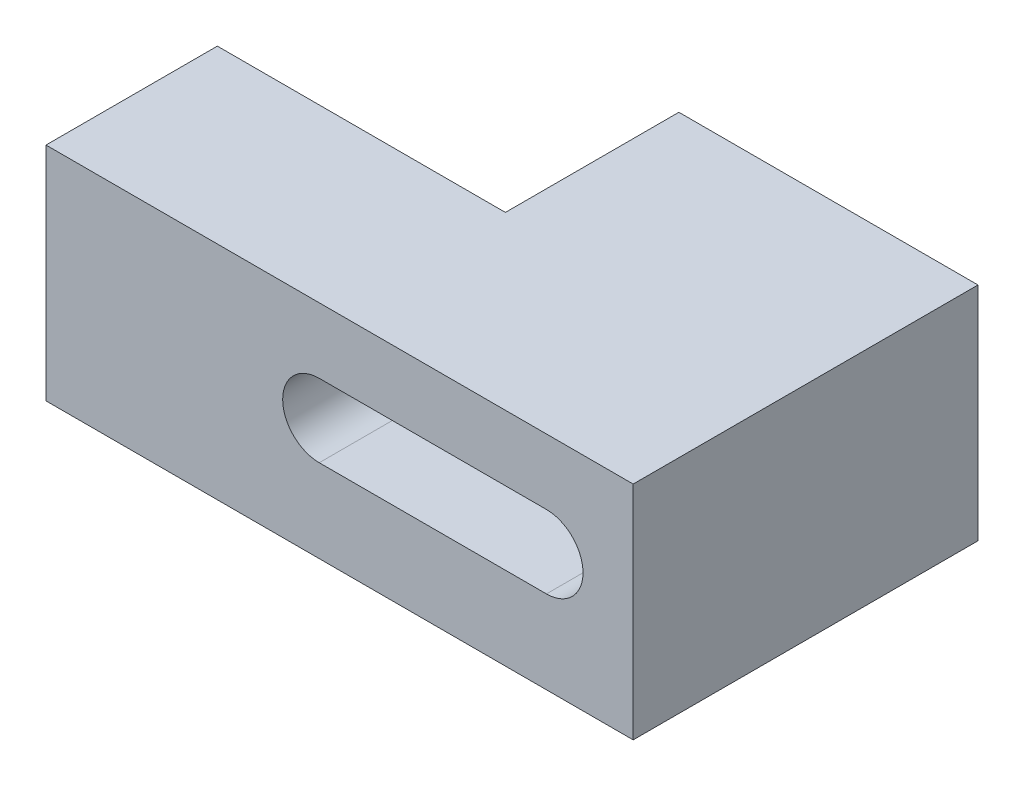
ISO-10303-21;
HEADER;
FILE_DESCRIPTION(('STEP AP214'),'2;1');
FILE_NAME('part.step','',(''),(''),'','','');
FILE_SCHEMA(('AUTOMOTIVE_DESIGN { 1 0 10303 214 1 1 1 1 }'));
ENDSEC;
DATA;
#1=APPLICATION_CONTEXT('core data for automotive mechanical design processes');
#2=APPLICATION_PROTOCOL_DEFINITION('international standard','automotive_design',2000,#1);
#3=PRODUCT_CONTEXT('',#1,'mechanical');
#4=PRODUCT('Part','Part','',(#3));
#5=PRODUCT_RELATED_PRODUCT_CATEGORY('part','',(#4));
#6=PRODUCT_DEFINITION_FORMATION('','',#4);
#7=PRODUCT_DEFINITION_CONTEXT('part definition',#1,'design');
#8=PRODUCT_DEFINITION('design','',#6,#7);
#9=PRODUCT_DEFINITION_SHAPE('','',#8);
#10=(LENGTH_UNIT() NAMED_UNIT(*) SI_UNIT(.MILLI.,.METRE.));
#11=(NAMED_UNIT(*) PLANE_ANGLE_UNIT() SI_UNIT($,.RADIAN.));
#12=(NAMED_UNIT(*) SI_UNIT($,.STERADIAN.) SOLID_ANGLE_UNIT());
#13=UNCERTAINTY_MEASURE_WITH_UNIT(LENGTH_MEASURE(1.E-05),#10,'distance_accuracy_value','');
#14=(GEOMETRIC_REPRESENTATION_CONTEXT(3) GLOBAL_UNCERTAINTY_ASSIGNED_CONTEXT((#13)) GLOBAL_UNIT_ASSIGNED_CONTEXT((#10,
#11,#12)) REPRESENTATION_CONTEXT('',''));
#15=CARTESIAN_POINT('',(0.,0.,0.));
#16=DIRECTION('',(0.,0.,1.));
#17=DIRECTION('',(1.,0.,0.));
#18=AXIS2_PLACEMENT_3D('',#15,#16,#17);
#19=CARTESIAN_POINT('',(165.000002458692,15.0000002235174,-31.5625));
#20=DIRECTION('',(1.,0.,0.));
#21=DIRECTION('',(0.,1.,0.));
#22=AXIS2_PLACEMENT_3D('',#19,#20,#21);
#23=PLANE('',#22);
#24=DIRECTION('',(0.,-1.,0.));
#25=VECTOR('',#24,1.);
#26=CARTESIAN_POINT('',(165.000002458692,15.0000002235174,-31.5625));
#27=LINE('',#26,#25);
#28=CARTESIAN_POINT('',(165.000002458692,24.1010300409955,-31.5625));
#29=VERTEX_POINT('',#28);
#30=CARTESIAN_POINT('',(165.000002458692,14.1010002235174,-31.5625));
#31=VERTEX_POINT('',#30);
#32=EDGE_CURVE('E154',#29,#31,#27,.T.);
#33=ORIENTED_EDGE('',*,*,#32,.F.);
#34=DIRECTION('',(0.,0.,1.));
#35=VECTOR('',#34,1.);
#36=CARTESIAN_POINT('',(165.000002458692,24.1010300409955,-20.0005));
#37=LINE('',#36,#35);
#38=CARTESIAN_POINT('',(165.000002458692,24.1010300409955,-16.0005));
#39=VERTEX_POINT('',#38);
#40=EDGE_CURVE('E203',#29,#39,#37,.T.);
#41=ORIENTED_EDGE('',*,*,#40,.T.);
#42=DIRECTION('',(0.,1.,0.));
#43=VECTOR('',#42,1.);
#44=CARTESIAN_POINT('',(165.000002458692,15.0000002235174,-16.0005));
#45=LINE('',#44,#43);
#46=CARTESIAN_POINT('',(165.000002458692,14.1010002235174,-16.0005));
#47=VERTEX_POINT('',#46);
#48=EDGE_CURVE('E216',#47,#39,#45,.T.);
#49=ORIENTED_EDGE('',*,*,#48,.F.);
#50=DIRECTION('',(0.,0.,1.));
#51=VECTOR('',#50,1.);
#52=CARTESIAN_POINT('',(165.000002458692,14.1010002235174,-31.5625));
#53=LINE('',#52,#51);
#54=EDGE_CURVE('E225',#31,#47,#53,.T.);
#55=ORIENTED_EDGE('',*,*,#54,.F.);
#56=EDGE_LOOP('',(#33,#41,#49,#55));
#57=FACE_BOUND('',#56,.T.);
#58=ADVANCED_FACE('F16',(#57),#23,.T.);
#59=CARTESIAN_POINT('',(151.500002145767,23.9300300409955,-31.5625));
#60=DIRECTION('',(-1.,0.,0.));
#61=DIRECTION('',(0.,1.,0.));
#62=AXIS2_PLACEMENT_3D('',#59,#60,#61);
#63=PLANE('',#62);
#64=DIRECTION('',(0.,0.,-1.));
#65=VECTOR('',#64,1.);
#66=CARTESIAN_POINT('',(151.500002145767,17.8498244738919,-25.7815));
#67=LINE('',#66,#65);
#68=CARTESIAN_POINT('',(151.500002145767,17.8498244738919,-23.7337633376718));
#69=VERTEX_POINT('',#68);
#70=CARTESIAN_POINT('',(151.500002145767,17.8498244738919,-31.5625));
#71=VERTEX_POINT('',#70);
#72=EDGE_CURVE('E145',#69,#71,#67,.T.);
#73=ORIENTED_EDGE('',*,*,#72,.T.);
#74=DIRECTION('',(0.,1.,0.));
#75=VECTOR('',#74,1.);
#76=CARTESIAN_POINT('',(151.500002145767,23.9300300409955,-31.5625));
#77=LINE('',#76,#75);
#78=CARTESIAN_POINT('',(151.500002145767,14.1010002235174,-31.5625));
#79=VERTEX_POINT('',#78);
#80=EDGE_CURVE('E141',#79,#71,#77,.T.);
#81=ORIENTED_EDGE('',*,*,#80,.F.);
#82=DIRECTION('',(0.,0.,-1.));
#83=VECTOR('',#82,1.);
#84=CARTESIAN_POINT('',(151.500002145767,14.1010002235174,-31.5625));
#85=LINE('',#84,#83);
#86=CARTESIAN_POINT('',(151.500002145767,14.1010002235174,-23.7337633376718));
#87=VERTEX_POINT('',#86);
#88=EDGE_CURVE('E127',#87,#79,#85,.T.);
#89=ORIENTED_EDGE('',*,*,#88,.F.);
#90=DIRECTION('',(0.,1.,0.));
#91=VECTOR('',#90,1.);
#92=CARTESIAN_POINT('',(151.500002145767,23.9300300409955,-23.7337633376718));
#93=LINE('',#92,#91);
#94=EDGE_CURVE('E27',#87,#69,#93,.T.);
#95=ORIENTED_EDGE('',*,*,#94,.T.);
#96=EDGE_LOOP('',(#73,#81,#89,#95));
#97=FACE_BOUND('',#96,.T.);
#98=ADVANCED_FACE('F142',(#97),#63,.T.);
#99=CARTESIAN_POINT('',(138.500002145767,19.4650151322565,-21.8671316688359));
#100=DIRECTION('',(-1.,0.,0.));
#101=DIRECTION('',(0.,0.,1.));
#102=AXIS2_PLACEMENT_3D('',#99,#100,#101);
#103=PLANE('',#102);
#104=DIRECTION('',(0.,0.,1.));
#105=VECTOR('',#104,1.);
#106=CARTESIAN_POINT('',(138.500002145767,24.1010300409955,-20.0005));
#107=LINE('',#106,#105);
#108=CARTESIAN_POINT('',(138.500002145767,24.1010300409955,-23.7337633376718));
#109=VERTEX_POINT('',#108);
#110=CARTESIAN_POINT('',(138.500002145767,24.1010300409955,-16.0005));
#111=VERTEX_POINT('',#110);
#112=EDGE_CURVE('E177',#109,#111,#107,.T.);
#113=ORIENTED_EDGE('',*,*,#112,.F.);
#114=DIRECTION('',(0.,1.,0.));
#115=VECTOR('',#114,1.);
#116=CARTESIAN_POINT('',(138.500002145767,23.9300300409955,-23.7337633376718));
#117=LINE('',#116,#115);
#118=CARTESIAN_POINT('',(138.500002145767,14.1010002235174,-23.7337633376718));
#119=VERTEX_POINT('',#118);
#120=EDGE_CURVE('E11',#119,#109,#117,.T.);
#121=ORIENTED_EDGE('',*,*,#120,.F.);
#122=DIRECTION('',(0.,0.,1.));
#123=VECTOR('',#122,1.);
#124=CARTESIAN_POINT('',(138.500002145767,14.1010002235174,-20.0005));
#125=LINE('',#124,#123);
#126=CARTESIAN_POINT('',(138.500002145767,14.1010002235174,-16.0005));
#127=VERTEX_POINT('',#126);
#128=EDGE_CURVE('E208',#119,#127,#125,.T.);
#129=ORIENTED_EDGE('',*,*,#128,.T.);
#130=DIRECTION('',(0.,-1.,0.));
#131=VECTOR('',#130,1.);
#132=CARTESIAN_POINT('',(138.500002145767,15.0000002235174,-16.0005));
#133=LINE('',#132,#131);
#134=EDGE_CURVE('E206',#111,#127,#133,.T.);
#135=ORIENTED_EDGE('',*,*,#134,.F.);
#136=EDGE_LOOP('',(#113,#121,#129,#135));
#137=FACE_BOUND('',#136,.T.);
#138=ADVANCED_FACE('F207',(#137),#103,.T.);
#139=CARTESIAN_POINT('',(151.500002145767,23.9300300409955,-23.7337633376718));
#140=DIRECTION('',(0.,0.,-1.));
#141=DIRECTION('',(0.,-1.,0.));
#142=AXIS2_PLACEMENT_3D('',#139,#140,#141);
#143=PLANE('',#142);
#144=DIRECTION('',(1.,0.,0.));
#145=VECTOR('',#144,1.);
#146=CARTESIAN_POINT('',(156.292681675131,17.8498244738918,-23.7337633376718));
#147=LINE('',#146,#145);
#148=CARTESIAN_POINT('',(150.831278461251,17.8498244738919,-23.7337633376718));
#149=VERTEX_POINT('',#148);
#150=EDGE_CURVE('E229',#149,#69,#147,.T.);
#151=ORIENTED_EDGE('',*,*,#150,.T.);
#152=ORIENTED_EDGE('',*,*,#94,.F.);
#153=DIRECTION('',(1.,0.,0.));
#154=VECTOR('',#153,1.);
#155=CARTESIAN_POINT('',(151.500002145767,14.1010002235174,-23.7337633376718));
#156=LINE('',#155,#154);
#157=EDGE_CURVE('E135',#119,#87,#156,.T.);
#158=ORIENTED_EDGE('',*,*,#157,.F.);
#159=ORIENTED_EDGE('',*,*,#120,.T.);
#160=DIRECTION('',(-1.,0.,0.));
#161=VECTOR('',#160,1.);
#162=CARTESIAN_POINT('',(151.500002145767,24.1010300409955,-23.7337633376718));
#163=LINE('',#162,#161);
#164=CARTESIAN_POINT('',(151.500002145767,24.1010300409955,-23.7337633376718));
#165=VERTEX_POINT('',#164);
#166=EDGE_CURVE('E167',#165,#109,#163,.T.);
#167=ORIENTED_EDGE('',*,*,#166,.F.);
#168=DIRECTION('',(0.,1.,0.));
#169=VECTOR('',#168,1.);
#170=CARTESIAN_POINT('',(151.500002145767,23.9300300409955,-23.7337633376718));
#171=LINE('',#170,#169);
#172=CARTESIAN_POINT('',(151.500002145767,21.1498241667674,-23.7337633376718));
#173=VERTEX_POINT('',#172);
#174=EDGE_CURVE('E149',#173,#165,#171,.T.);
#175=ORIENTED_EDGE('',*,*,#174,.F.);
#176=DIRECTION('',(-0.999999999999895,4.59269197774688E-07,0.));
#177=VECTOR('',#176,1.);
#178=CARTESIAN_POINT('',(151.165639651572,21.1498243203298,-23.7337633376718));
#179=LINE('',#178,#177);
#180=CARTESIAN_POINT('',(150.831278434239,21.1498244738916,-23.7337633376718));
#181=VERTEX_POINT('',#180);
#182=EDGE_CURVE('E192',#173,#181,#179,.T.);
#183=ORIENTED_EDGE('',*,*,#182,.T.);
#184=CARTESIAN_POINT('',(150.831277676445,19.4998244738918,-23.7337633376718));
#185=DIRECTION('',(0.,0.,1.));
#186=DIRECTION('',(-1.,0.,0.));
#187=AXIS2_PLACEMENT_3D('',#184,#185,#186);
#188=CIRCLE('',#187,1.65);
#189=EDGE_CURVE('E240',#181,#149,#188,.T.);
#190=ORIENTED_EDGE('',*,*,#189,.T.);
#191=EDGE_LOOP('',(#151,#152,#158,#159,#167,#175,#183,#190));
#192=FACE_BOUND('',#191,.T.);
#193=ADVANCED_FACE('F190',(#192),#143,.T.);
#194=CARTESIAN_POINT('',(151.500002145767,14.1010002235174,-31.5625));
#195=DIRECTION('',(0.,-1.,0.));
#196=DIRECTION('',(0.,0.,-1.));
#197=AXIS2_PLACEMENT_3D('',#194,#195,#196);
#198=PLANE('',#197);
#199=DIRECTION('',(1.,0.,0.));
#200=VECTOR('',#199,1.);
#201=CARTESIAN_POINT('',(165.000002458692,14.1010002235174,-31.5625));
#202=LINE('',#201,#200);
#203=EDGE_CURVE('E132',#79,#31,#202,.T.);
#204=ORIENTED_EDGE('',*,*,#203,.T.);
#205=ORIENTED_EDGE('',*,*,#54,.T.);
#206=DIRECTION('',(1.,0.,0.));
#207=VECTOR('',#206,1.);
#208=CARTESIAN_POINT('',(151.500002145767,14.1010002235174,-16.0005));
#209=LINE('',#208,#207);
#210=EDGE_CURVE('E213',#127,#47,#209,.T.);
#211=ORIENTED_EDGE('',*,*,#210,.F.);
#212=ORIENTED_EDGE('',*,*,#128,.F.);
#213=ORIENTED_EDGE('',*,*,#157,.T.);
#214=ORIENTED_EDGE('',*,*,#88,.T.);
#215=EDGE_LOOP('',(#204,#205,#211,#212,#213,#214));
#216=FACE_BOUND('',#215,.T.);
#217=ADVANCED_FACE('F129',(#216),#198,.T.);
#218=CARTESIAN_POINT('',(165.000002458692,24.1010300409955,-31.5625));
#219=DIRECTION('',(0.,1.,0.));
#220=DIRECTION('',(1.,0.,0.));
#221=AXIS2_PLACEMENT_3D('',#218,#219,#220);
#222=PLANE('',#221);
#223=DIRECTION('',(-1.,0.,0.));
#224=VECTOR('',#223,1.);
#225=CARTESIAN_POINT('',(151.500002145767,24.1010300409955,-31.5625));
#226=LINE('',#225,#224);
#227=CARTESIAN_POINT('',(151.500002145767,24.1010300409955,-31.5625));
#228=VERTEX_POINT('',#227);
#229=EDGE_CURVE('E20',#29,#228,#226,.T.);
#230=ORIENTED_EDGE('',*,*,#229,.T.);
#231=DIRECTION('',(0.,0.,1.));
#232=VECTOR('',#231,1.);
#233=CARTESIAN_POINT('',(151.500002145767,24.1010300409955,-31.5625));
#234=LINE('',#233,#232);
#235=EDGE_CURVE('E164',#228,#165,#234,.T.);
#236=ORIENTED_EDGE('',*,*,#235,.T.);
#237=ORIENTED_EDGE('',*,*,#166,.T.);
#238=ORIENTED_EDGE('',*,*,#112,.T.);
#239=DIRECTION('',(-1.,0.,0.));
#240=VECTOR('',#239,1.);
#241=CARTESIAN_POINT('',(151.500002145767,24.1010300409955,-16.0005));
#242=LINE('',#241,#240);
#243=EDGE_CURVE('E199',#39,#111,#242,.T.);
#244=ORIENTED_EDGE('',*,*,#243,.F.);
#245=ORIENTED_EDGE('',*,*,#40,.F.);
#246=EDGE_LOOP('',(#230,#236,#237,#238,#244,#245));
#247=FACE_BOUND('',#246,.T.);
#248=ADVANCED_FACE('F194',(#247),#222,.T.);
#249=CARTESIAN_POINT('',(151.500002145767,23.9300300409955,-31.5625));
#250=DIRECTION('',(-1.,0.,0.));
#251=DIRECTION('',(0.,1.,0.));
#252=AXIS2_PLACEMENT_3D('',#249,#250,#251);
#253=PLANE('',#252);
#254=DIRECTION('',(0.,0.,1.));
#255=VECTOR('',#254,1.);
#256=CARTESIAN_POINT('',(151.500002145767,21.1498241667674,-25.7815));
#257=LINE('',#256,#255);
#258=CARTESIAN_POINT('',(151.500002145767,21.1498241667674,-31.5625));
#259=VERTEX_POINT('',#258);
#260=EDGE_CURVE('E187',#259,#173,#257,.T.);
#261=ORIENTED_EDGE('',*,*,#260,.T.);
#262=ORIENTED_EDGE('',*,*,#174,.T.);
#263=ORIENTED_EDGE('',*,*,#235,.F.);
#264=DIRECTION('',(0.,1.,0.));
#265=VECTOR('',#264,1.);
#266=CARTESIAN_POINT('',(151.500002145767,23.9300300409955,-31.5625));
#267=LINE('',#266,#265);
#268=EDGE_CURVE('E243',#259,#228,#267,.T.);
#269=ORIENTED_EDGE('',*,*,#268,.F.);
#270=EDGE_LOOP('',(#261,#262,#263,#269));
#271=FACE_BOUND('',#270,.T.);
#272=ADVANCED_FACE('F183',(#271),#253,.T.);
#273=CARTESIAN_POINT('',(158.250002302229,19.4650151322565,-31.5625));
#274=DIRECTION('',(0.,0.,1.));
#275=DIRECTION('',(1.,0.,0.));
#276=AXIS2_PLACEMENT_3D('',#273,#274,#275);
#277=PLANE('',#276);
#278=DIRECTION('',(1.,0.,0.));
#279=VECTOR('',#278,1.);
#280=CARTESIAN_POINT('',(159.667681753362,17.8498244738918,-31.5625));
#281=LINE('',#280,#279);
#282=CARTESIAN_POINT('',(161.085361204494,17.8498244738918,-31.5625));
#283=VERTEX_POINT('',#282);
#284=EDGE_CURVE('E230',#71,#283,#281,.T.);
#285=ORIENTED_EDGE('',*,*,#284,.T.);
#286=CARTESIAN_POINT('',(161.085361204494,19.4998244738918,-31.5625));
#287=DIRECTION('',(0.,0.,1.));
#288=DIRECTION('',(-1.,0.,0.));
#289=AXIS2_PLACEMENT_3D('',#286,#287,#288);
#290=CIRCLE('',#289,1.65);
#291=CARTESIAN_POINT('',(161.083085930853,21.1498197655522,-31.5625));
#292=VERTEX_POINT('',#291);
#293=EDGE_CURVE('E251',#283,#292,#290,.T.);
#294=ORIENTED_EDGE('',*,*,#293,.T.);
#295=DIRECTION('',(-0.999999999999895,4.59269197774688E-07,0.));
#296=VECTOR('',#295,1.);
#297=CARTESIAN_POINT('',(154.540640755124,21.1498227702957,-31.5625));
#298=LINE('',#297,#296);
#299=EDGE_CURVE('E239',#292,#259,#298,.T.);
#300=ORIENTED_EDGE('',*,*,#299,.T.);
#301=ORIENTED_EDGE('',*,*,#268,.T.);
#302=ORIENTED_EDGE('',*,*,#229,.F.);
#303=ORIENTED_EDGE('',*,*,#32,.T.);
#304=ORIENTED_EDGE('',*,*,#203,.F.);
#305=ORIENTED_EDGE('',*,*,#80,.T.);
#306=EDGE_LOOP('',(#285,#294,#300,#301,#302,#303,#304,#305));
#307=FACE_BOUND('',#306,.T.);
#308=ADVANCED_FACE('F151',(#307),#277,.F.);
#309=CARTESIAN_POINT('',(161.085361204494,17.8498244738918,-20.0005));
#310=DIRECTION('',(0.,-1.,0.));
#311=DIRECTION('',(-1.,0.,0.));
#312=AXIS2_PLACEMENT_3D('',#309,#310,#311);
#313=PLANE('',#312);
#314=ORIENTED_EDGE('',*,*,#284,.F.);
#315=ORIENTED_EDGE('',*,*,#72,.F.);
#316=ORIENTED_EDGE('',*,*,#150,.F.);
#317=DIRECTION('',(0.,0.,-1.));
#318=VECTOR('',#317,1.);
#319=CARTESIAN_POINT('',(150.831278461251,17.8498244738919,-20.0005));
#320=LINE('',#319,#318);
#321=CARTESIAN_POINT('',(150.831278461251,17.8498244738919,-16.0005));
#322=VERTEX_POINT('',#321);
#323=EDGE_CURVE('E101',#322,#149,#320,.T.);
#324=ORIENTED_EDGE('',*,*,#323,.F.);
#325=DIRECTION('',(-1.,0.,0.));
#326=VECTOR('',#325,1.);
#327=CARTESIAN_POINT('',(159.667681753362,17.8498244738918,-16.0005));
#328=LINE('',#327,#326);
#329=CARTESIAN_POINT('',(161.085361204494,17.8498244738918,-16.0005));
#330=VERTEX_POINT('',#329);
#331=EDGE_CURVE('E236',#330,#322,#328,.T.);
#332=ORIENTED_EDGE('',*,*,#331,.F.);
#333=DIRECTION('',(0.,0.,1.));
#334=VECTOR('',#333,1.);
#335=CARTESIAN_POINT('',(161.085361204494,17.8498244738918,-20.0005));
#336=LINE('',#335,#334);
#337=EDGE_CURVE('E256',#283,#330,#336,.T.);
#338=ORIENTED_EDGE('',*,*,#337,.F.);
#339=EDGE_LOOP('',(#314,#315,#316,#324,#332,#338));
#340=FACE_BOUND('',#339,.T.);
#341=ADVANCED_FACE('F287',(#340),#313,.F.);
#342=CARTESIAN_POINT('',(150.831277676445,19.4998244738918,-20.0005));
#343=DIRECTION('',(0.,0.,-1.));
#344=DIRECTION('',(-1.,0.,0.));
#345=AXIS2_PLACEMENT_3D('',#342,#343,#344);
#346=CYLINDRICAL_SURFACE('',#345,1.65);
#347=ORIENTED_EDGE('',*,*,#189,.F.);
#348=DIRECTION('',(0.,0.,-1.));
#349=VECTOR('',#348,1.);
#350=CARTESIAN_POINT('',(150.831278434239,21.1498244738916,-20.0005));
#351=LINE('',#350,#349);
#352=CARTESIAN_POINT('',(150.831278434239,21.1498244738916,-16.0005));
#353=VERTEX_POINT('',#352);
#354=EDGE_CURVE('E111',#353,#181,#351,.T.);
#355=ORIENTED_EDGE('',*,*,#354,.F.);
#356=CARTESIAN_POINT('',(150.831277676445,19.4998244738918,-16.0005));
#357=DIRECTION('',(0.,0.,-1.));
#358=DIRECTION('',(-1.,0.,0.));
#359=AXIS2_PLACEMENT_3D('',#356,#357,#358);
#360=CIRCLE('',#359,1.65);
#361=EDGE_CURVE('E252',#322,#353,#360,.T.);
#362=ORIENTED_EDGE('',*,*,#361,.F.);
#363=ORIENTED_EDGE('',*,*,#323,.T.);
#364=EDGE_LOOP('',(#347,#355,#362,#363));
#365=FACE_BOUND('',#364,.T.);
#366=ADVANCED_FACE('F358',(#365),#346,.F.);
#367=CARTESIAN_POINT('',(150.831278434239,21.1498244738916,-20.0005));
#368=DIRECTION('',(4.59269197774688E-07,0.999999999999895,0.));
#369=DIRECTION('',(3.45338398483141E-10,0.,-1.));
#370=AXIS2_PLACEMENT_3D('',#367,#368,#369);
#371=PLANE('',#370);
#372=ORIENTED_EDGE('',*,*,#299,.F.);
#373=DIRECTION('',(0.,0.,-1.));
#374=VECTOR('',#373,1.);
#375=CARTESIAN_POINT('',(161.083085930853,21.1498197655522,-20.0005));
#376=LINE('',#375,#374);
#377=CARTESIAN_POINT('',(161.083085930853,21.1498197655522,-20.0005));
#378=VERTEX_POINT('',#377);
#379=EDGE_CURVE('E224',#378,#292,#376,.T.);
#380=ORIENTED_EDGE('',*,*,#379,.F.);
#381=DIRECTION('',(0.,0.,1.));
#382=VECTOR('',#381,1.);
#383=CARTESIAN_POINT('',(161.083085930853,21.1498197655522,-20.0005));
#384=LINE('',#383,#382);
#385=CARTESIAN_POINT('',(161.083085930853,21.1498197655522,-16.0005));
#386=VERTEX_POINT('',#385);
#387=EDGE_CURVE('E274',#378,#386,#384,.T.);
#388=ORIENTED_EDGE('',*,*,#387,.T.);
#389=DIRECTION('',(0.999999999999895,-4.59269197774688E-07,0.));
#390=VECTOR('',#389,1.);
#391=CARTESIAN_POINT('',(154.540640755124,21.1498227702957,-16.0005));
#392=LINE('',#391,#390);
#393=EDGE_CURVE('E247',#353,#386,#392,.T.);
#394=ORIENTED_EDGE('',*,*,#393,.F.);
#395=ORIENTED_EDGE('',*,*,#354,.T.);
#396=ORIENTED_EDGE('',*,*,#182,.F.);
#397=ORIENTED_EDGE('',*,*,#260,.F.);
#398=EDGE_LOOP('',(#372,#380,#388,#394,#395,#396,#397));
#399=FACE_BOUND('',#398,.T.);
#400=ADVANCED_FACE('F298',(#399),#371,.F.);
#401=CARTESIAN_POINT('',(161.085361204494,19.4998244738918,-20.0005));
#402=DIRECTION('',(0.,0.,-1.));
#403=DIRECTION('',(0.999999762309783,0.00068947833680222,0.));
#404=AXIS2_PLACEMENT_3D('',#401,#402,#403);
#405=CYLINDRICAL_SURFACE('',#404,1.65);
#406=ORIENTED_EDGE('',*,*,#293,.F.);
#407=ORIENTED_EDGE('',*,*,#337,.T.);
#408=CARTESIAN_POINT('',(161.085361204494,19.4998244738918,-16.0005));
#409=DIRECTION('',(0.,0.,-1.));
#410=DIRECTION('',(-1.,0.,0.));
#411=AXIS2_PLACEMENT_3D('',#408,#409,#410);
#412=CIRCLE('',#411,1.65);
#413=EDGE_CURVE('E232',#386,#330,#412,.T.);
#414=ORIENTED_EDGE('',*,*,#413,.F.);
#415=ORIENTED_EDGE('',*,*,#387,.F.);
#416=ORIENTED_EDGE('',*,*,#379,.T.);
#417=EDGE_LOOP('',(#406,#407,#414,#415,#416));
#418=FACE_BOUND('',#417,.T.);
#419=ADVANCED_FACE('F293',(#418),#405,.F.);
#420=CARTESIAN_POINT('',(158.250002302229,19.4650151322565,-16.0005));
#421=DIRECTION('',(0.,0.,1.));
#422=DIRECTION('',(1.,0.,0.));
#423=AXIS2_PLACEMENT_3D('',#420,#421,#422);
#424=PLANE('',#423);
#425=ORIENTED_EDGE('',*,*,#413,.T.);
#426=ORIENTED_EDGE('',*,*,#331,.T.);
#427=ORIENTED_EDGE('',*,*,#361,.T.);
#428=ORIENTED_EDGE('',*,*,#393,.T.);
#429=EDGE_LOOP('',(#425,#426,#427,#428));
#430=FACE_BOUND('',#429,.T.);
#431=ORIENTED_EDGE('',*,*,#48,.T.);
#432=ORIENTED_EDGE('',*,*,#243,.T.);
#433=ORIENTED_EDGE('',*,*,#134,.T.);
#434=ORIENTED_EDGE('',*,*,#210,.T.);
#435=EDGE_LOOP('',(#431,#432,#433,#434));
#436=FACE_BOUND('',#435,.T.);
#437=ADVANCED_FACE('F18',(#430,#436),#424,.T.);
#438=CLOSED_SHELL('',(#58,#98,#138,#193,#217,#248,#272,#308,#341,#366,#400,#419,#437));
#439=MANIFOLD_SOLID_BREP('B1',#438);
#440=ADVANCED_BREP_SHAPE_REPRESENTATION('',(#18,#439),#14);
#441=SHAPE_DEFINITION_REPRESENTATION(#9,#440);
ENDSEC;
END-ISO-10303-21;
